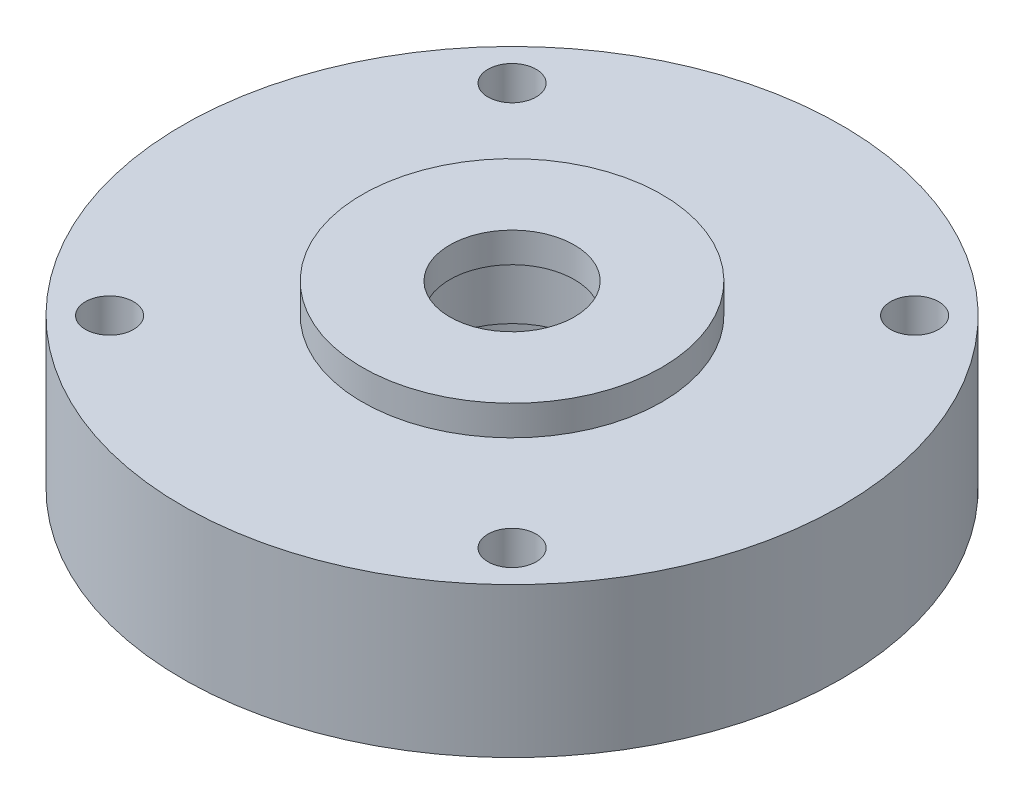
ISO-10303-21;
HEADER;
FILE_DESCRIPTION(('STEP AP214'),'2;1');
FILE_NAME('part.step','',(''),(''),'','','');
FILE_SCHEMA(('AUTOMOTIVE_DESIGN { 1 0 10303 214 1 1 1 1 }'));
ENDSEC;
DATA;
#1=APPLICATION_CONTEXT('core data for automotive mechanical design processes');
#2=APPLICATION_PROTOCOL_DEFINITION('international standard','automotive_design',2000,#1);
#3=PRODUCT_CONTEXT('',#1,'mechanical');
#4=PRODUCT('Part','Part','',(#3));
#5=PRODUCT_RELATED_PRODUCT_CATEGORY('part','',(#4));
#6=PRODUCT_DEFINITION_FORMATION('','',#4);
#7=PRODUCT_DEFINITION_CONTEXT('part definition',#1,'design');
#8=PRODUCT_DEFINITION('design','',#6,#7);
#9=PRODUCT_DEFINITION_SHAPE('','',#8);
#10=(LENGTH_UNIT() NAMED_UNIT(*) SI_UNIT(.MILLI.,.METRE.));
#11=(NAMED_UNIT(*) PLANE_ANGLE_UNIT() SI_UNIT($,.RADIAN.));
#12=(NAMED_UNIT(*) SI_UNIT($,.STERADIAN.) SOLID_ANGLE_UNIT());
#13=UNCERTAINTY_MEASURE_WITH_UNIT(LENGTH_MEASURE(1.E-05),#10,'distance_accuracy_value','');
#14=(GEOMETRIC_REPRESENTATION_CONTEXT(3) GLOBAL_UNCERTAINTY_ASSIGNED_CONTEXT((#13)) GLOBAL_UNIT_ASSIGNED_CONTEXT((#10,
#11,#12)) REPRESENTATION_CONTEXT('',''));
#15=CARTESIAN_POINT('',(0.,0.,0.));
#16=DIRECTION('',(0.,0.,1.));
#17=DIRECTION('',(1.,0.,0.));
#18=AXIS2_PLACEMENT_3D('',#15,#16,#17);
#19=CARTESIAN_POINT('',(-7.9375,9.525,0.));
#20=DIRECTION('',(0.,1.,0.));
#21=DIRECTION('',(-1.,0.,0.));
#22=AXIS2_PLACEMENT_3D('',#19,#20,#21);
#23=PLANE('',#22);
#24=CARTESIAN_POINT('',(0.,9.525,0.));
#25=DIRECTION('',(0.,-1.,0.));
#26=DIRECTION('',(1.,0.,0.));
#27=AXIS2_PLACEMENT_3D('',#24,#25,#26);
#28=CIRCLE('',#27,7.9375);
#29=CARTESIAN_POINT('',(7.9375,9.525,0.));
#30=VERTEX_POINT('',#29);
#31=EDGE_CURVE('E90',#30,#30,#28,.T.);
#32=ORIENTED_EDGE('',*,*,#31,.F.);
#33=EDGE_LOOP('',(#32));
#34=FACE_BOUND('',#33,.T.);
#35=CARTESIAN_POINT('',(0.,9.525,0.));
#36=DIRECTION('',(0.,-1.,0.));
#37=DIRECTION('',(1.,0.,0.));
#38=AXIS2_PLACEMENT_3D('',#35,#36,#37);
#39=CIRCLE('',#38,15.0125);
#40=CARTESIAN_POINT('',(15.0125,9.525,0.));
#41=VERTEX_POINT('',#40);
#42=EDGE_CURVE('E10',#41,#41,#39,.T.);
#43=ORIENTED_EDGE('',*,*,#42,.T.);
#44=EDGE_LOOP('',(#43));
#45=FACE_BOUND('',#44,.T.);
#46=ADVANCED_FACE('F41',(#34,#45),#23,.F.);
#47=CARTESIAN_POINT('',(0.,0.,0.));
#48=DIRECTION('',(0.,-1.,0.));
#49=DIRECTION('',(1.,0.,0.));
#50=AXIS2_PLACEMENT_3D('',#47,#48,#49);
#51=CYLINDRICAL_SURFACE('',#50,15.0125);
#52=ORIENTED_EDGE('',*,*,#42,.F.);
#53=EDGE_LOOP('',(#52));
#54=FACE_BOUND('',#53,.T.);
#55=CARTESIAN_POINT('',(0.,0.,0.));
#56=DIRECTION('',(0.,-1.,0.));
#57=DIRECTION('',(1.,0.,0.));
#58=AXIS2_PLACEMENT_3D('',#55,#56,#57);
#59=CIRCLE('',#58,15.0125);
#60=CARTESIAN_POINT('',(15.0125,0.,0.));
#61=VERTEX_POINT('',#60);
#62=EDGE_CURVE('E48',#61,#61,#59,.T.);
#63=ORIENTED_EDGE('',*,*,#62,.T.);
#64=EDGE_LOOP('',(#63));
#65=FACE_BOUND('',#64,.T.);
#66=ADVANCED_FACE('F167',(#54,#65),#51,.F.);
#67=CARTESIAN_POINT('',(-20.6375,0.,0.));
#68=DIRECTION('',(0.,1.,0.));
#69=DIRECTION('',(-1.,0.,0.));
#70=AXIS2_PLACEMENT_3D('',#67,#68,#69);
#71=PLANE('',#70);
#72=ORIENTED_EDGE('',*,*,#62,.F.);
#73=EDGE_LOOP('',(#72));
#74=FACE_BOUND('',#73,.T.);
#75=CARTESIAN_POINT('',(0.,0.,0.));
#76=DIRECTION('',(0.,-1.,0.));
#77=DIRECTION('',(1.,0.,0.));
#78=AXIS2_PLACEMENT_3D('',#75,#76,#77);
#79=CIRCLE('',#78,20.6375);
#80=CARTESIAN_POINT('',(20.6375,0.,0.));
#81=VERTEX_POINT('',#80);
#82=EDGE_CURVE('E53',#81,#81,#79,.T.);
#83=ORIENTED_EDGE('',*,*,#82,.T.);
#84=EDGE_LOOP('',(#83));
#85=FACE_BOUND('',#84,.T.);
#86=ADVANCED_FACE('F171',(#74,#85),#71,.F.);
#87=CARTESIAN_POINT('',(0.,0.,0.));
#88=DIRECTION('',(0.,-1.,0.));
#89=DIRECTION('',(1.,0.,0.));
#90=AXIS2_PLACEMENT_3D('',#87,#88,#89);
#91=CYLINDRICAL_SURFACE('',#90,20.6375);
#92=ORIENTED_EDGE('',*,*,#82,.F.);
#93=EDGE_LOOP('',(#92));
#94=FACE_BOUND('',#93,.T.);
#95=CARTESIAN_POINT('',(0.,3.1369,0.));
#96=DIRECTION('',(0.,-1.,0.));
#97=DIRECTION('',(1.,0.,0.));
#98=AXIS2_PLACEMENT_3D('',#95,#96,#97);
#99=CIRCLE('',#98,20.6375);
#100=CARTESIAN_POINT('',(20.6375,3.1369,0.));
#101=VERTEX_POINT('',#100);
#102=EDGE_CURVE('E57',#101,#101,#99,.T.);
#103=ORIENTED_EDGE('',*,*,#102,.T.);
#104=EDGE_LOOP('',(#103));
#105=FACE_BOUND('',#104,.T.);
#106=ADVANCED_FACE('F176',(#94,#105),#91,.T.);
#107=CARTESIAN_POINT('',(-25.4,3.1369,0.));
#108=DIRECTION('',(0.,1.,0.));
#109=DIRECTION('',(-1.,0.,0.));
#110=AXIS2_PLACEMENT_3D('',#107,#108,#109);
#111=PLANE('',#110);
#112=ORIENTED_EDGE('',*,*,#102,.F.);
#113=EDGE_LOOP('',(#112));
#114=FACE_BOUND('',#113,.T.);
#115=CARTESIAN_POINT('',(0.,3.1369,0.));
#116=DIRECTION('',(0.,-1.,0.));
#117=DIRECTION('',(1.,0.,0.));
#118=AXIS2_PLACEMENT_3D('',#115,#116,#117);
#119=CIRCLE('',#118,25.4);
#120=CARTESIAN_POINT('',(25.4,3.1369,0.));
#121=VERTEX_POINT('',#120);
#122=EDGE_CURVE('E62',#121,#121,#119,.T.);
#123=ORIENTED_EDGE('',*,*,#122,.T.);
#124=EDGE_LOOP('',(#123));
#125=FACE_BOUND('',#124,.T.);
#126=ADVANCED_FACE('F182',(#114,#125),#111,.F.);
#127=CARTESIAN_POINT('',(0.,0.,0.));
#128=DIRECTION('',(0.,-1.,0.));
#129=DIRECTION('',(1.,0.,0.));
#130=AXIS2_PLACEMENT_3D('',#127,#128,#129);
#131=CYLINDRICAL_SURFACE('',#130,25.4);
#132=ORIENTED_EDGE('',*,*,#122,.F.);
#133=EDGE_LOOP('',(#132));
#134=FACE_BOUND('',#133,.T.);
#135=CARTESIAN_POINT('',(0.,0.,0.));
#136=DIRECTION('',(0.,-1.,0.));
#137=DIRECTION('',(1.,0.,0.));
#138=AXIS2_PLACEMENT_3D('',#135,#136,#137);
#139=CIRCLE('',#138,25.4);
#140=CARTESIAN_POINT('',(25.4,0.,0.));
#141=VERTEX_POINT('',#140);
#142=EDGE_CURVE('E66',#141,#141,#139,.T.);
#143=ORIENTED_EDGE('',*,*,#142,.T.);
#144=EDGE_LOOP('',(#143));
#145=FACE_BOUND('',#144,.T.);
#146=ADVANCED_FACE('F186',(#134,#145),#131,.F.);
#147=CARTESIAN_POINT('',(-34.925,0.,0.));
#148=DIRECTION('',(0.,1.,0.));
#149=DIRECTION('',(-1.,0.,0.));
#150=AXIS2_PLACEMENT_3D('',#147,#148,#149);
#151=PLANE('',#150);
#152=CARTESIAN_POINT('',(-21.3281082875394,0.,-21.3281082875391));
#153=DIRECTION('',(0.,1.,0.));
#154=DIRECTION('',(0.,0.,1.));
#155=AXIS2_PLACEMENT_3D('',#152,#153,#154);
#156=CIRCLE('',#155,2.5527);
#157=CARTESIAN_POINT('',(-21.3281082875394,0.,-18.7754082875391));
#158=VERTEX_POINT('',#157);
#159=EDGE_CURVE('E111',#158,#158,#156,.T.);
#160=ORIENTED_EDGE('',*,*,#159,.T.);
#161=EDGE_LOOP('',(#160));
#162=FACE_BOUND('',#161,.T.);
#163=CARTESIAN_POINT('',(21.3281082875391,0.,-21.3281082875394));
#164=DIRECTION('',(0.,1.,0.));
#165=DIRECTION('',(0.,0.,1.));
#166=AXIS2_PLACEMENT_3D('',#163,#164,#165);
#167=CIRCLE('',#166,2.5527);
#168=CARTESIAN_POINT('',(21.3281082875391,0.,-18.7754082875394));
#169=VERTEX_POINT('',#168);
#170=EDGE_CURVE('E105',#169,#169,#167,.T.);
#171=ORIENTED_EDGE('',*,*,#170,.T.);
#172=EDGE_LOOP('',(#171));
#173=FACE_BOUND('',#172,.T.);
#174=CARTESIAN_POINT('',(21.3281082875394,0.,21.3281082875391));
#175=DIRECTION('',(0.,1.,0.));
#176=DIRECTION('',(0.,0.,1.));
#177=AXIS2_PLACEMENT_3D('',#174,#175,#176);
#178=CIRCLE('',#177,2.5527);
#179=CARTESIAN_POINT('',(21.3281082875394,0.,23.8808082875391));
#180=VERTEX_POINT('',#179);
#181=EDGE_CURVE('E99',#180,#180,#178,.T.);
#182=ORIENTED_EDGE('',*,*,#181,.T.);
#183=EDGE_LOOP('',(#182));
#184=FACE_BOUND('',#183,.T.);
#185=CARTESIAN_POINT('',(-21.3281082875391,0.,21.3281082875394));
#186=DIRECTION('',(0.,1.,0.));
#187=DIRECTION('',(0.,0.,1.));
#188=AXIS2_PLACEMENT_3D('',#185,#186,#187);
#189=CIRCLE('',#188,2.5527);
#190=CARTESIAN_POINT('',(-21.3281082875391,0.,23.8808082875394));
#191=VERTEX_POINT('',#190);
#192=EDGE_CURVE('E93',#191,#191,#189,.T.);
#193=ORIENTED_EDGE('',*,*,#192,.T.);
#194=EDGE_LOOP('',(#193));
#195=FACE_BOUND('',#194,.T.);
#196=ORIENTED_EDGE('',*,*,#142,.F.);
#197=EDGE_LOOP('',(#196));
#198=FACE_BOUND('',#197,.T.);
#199=CARTESIAN_POINT('',(0.,0.,0.));
#200=DIRECTION('',(0.,-1.,0.));
#201=DIRECTION('',(1.,0.,0.));
#202=AXIS2_PLACEMENT_3D('',#199,#200,#201);
#203=CIRCLE('',#202,34.925);
#204=CARTESIAN_POINT('',(34.925,0.,0.));
#205=VERTEX_POINT('',#204);
#206=EDGE_CURVE('E69',#205,#205,#203,.T.);
#207=ORIENTED_EDGE('',*,*,#206,.T.);
#208=EDGE_LOOP('',(#207));
#209=FACE_BOUND('',#208,.T.);
#210=ADVANCED_FACE('F190',(#162,#173,#184,#195,#198,#209),#151,.F.);
#211=CARTESIAN_POINT('',(0.,0.,0.));
#212=DIRECTION('',(0.,-1.,0.));
#213=DIRECTION('',(1.,0.,0.));
#214=AXIS2_PLACEMENT_3D('',#211,#212,#213);
#215=CYLINDRICAL_SURFACE('',#214,34.925);
#216=ORIENTED_EDGE('',*,*,#206,.F.);
#217=EDGE_LOOP('',(#216));
#218=FACE_BOUND('',#217,.T.);
#219=CARTESIAN_POINT('',(0.,15.875,0.));
#220=DIRECTION('',(0.,-1.,0.));
#221=DIRECTION('',(1.,0.,0.));
#222=AXIS2_PLACEMENT_3D('',#219,#220,#221);
#223=CIRCLE('',#222,34.925);
#224=CARTESIAN_POINT('',(34.925,15.875,0.));
#225=VERTEX_POINT('',#224);
#226=EDGE_CURVE('E72',#225,#225,#223,.T.);
#227=ORIENTED_EDGE('',*,*,#226,.T.);
#228=EDGE_LOOP('',(#227));
#229=FACE_BOUND('',#228,.T.);
#230=ADVANCED_FACE('F124',(#218,#229),#215,.T.);
#231=CARTESIAN_POINT('',(-15.875,15.875,0.));
#232=DIRECTION('',(0.,-1.,0.));
#233=DIRECTION('',(1.,0.,0.));
#234=AXIS2_PLACEMENT_3D('',#231,#232,#233);
#235=PLANE('',#234);
#236=CARTESIAN_POINT('',(-21.3281082875394,15.875,-21.3281082875391));
#237=DIRECTION('',(0.,1.,0.));
#238=DIRECTION('',(0.,0.,1.));
#239=AXIS2_PLACEMENT_3D('',#236,#237,#238);
#240=CIRCLE('',#239,2.55269999999999);
#241=CARTESIAN_POINT('',(-21.3281082875394,15.875,-18.7754082875391));
#242=VERTEX_POINT('',#241);
#243=EDGE_CURVE('E114',#242,#242,#240,.T.);
#244=ORIENTED_EDGE('',*,*,#243,.F.);
#245=EDGE_LOOP('',(#244));
#246=FACE_BOUND('',#245,.T.);
#247=CARTESIAN_POINT('',(21.3281082875391,15.875,-21.3281082875394));
#248=DIRECTION('',(0.,1.,0.));
#249=DIRECTION('',(0.,0.,1.));
#250=AXIS2_PLACEMENT_3D('',#247,#248,#249);
#251=CIRCLE('',#250,2.55269999999999);
#252=CARTESIAN_POINT('',(21.3281082875391,15.875,-18.7754082875394));
#253=VERTEX_POINT('',#252);
#254=EDGE_CURVE('E108',#253,#253,#251,.T.);
#255=ORIENTED_EDGE('',*,*,#254,.F.);
#256=EDGE_LOOP('',(#255));
#257=FACE_BOUND('',#256,.T.);
#258=CARTESIAN_POINT('',(21.3281082875394,15.875,21.3281082875391));
#259=DIRECTION('',(0.,1.,0.));
#260=DIRECTION('',(0.,0.,1.));
#261=AXIS2_PLACEMENT_3D('',#258,#259,#260);
#262=CIRCLE('',#261,2.55269999999999);
#263=CARTESIAN_POINT('',(21.3281082875394,15.875,23.8808082875391));
#264=VERTEX_POINT('',#263);
#265=EDGE_CURVE('E102',#264,#264,#262,.T.);
#266=ORIENTED_EDGE('',*,*,#265,.F.);
#267=EDGE_LOOP('',(#266));
#268=FACE_BOUND('',#267,.T.);
#269=CARTESIAN_POINT('',(-21.3281082875391,15.875,21.3281082875394));
#270=DIRECTION('',(0.,1.,0.));
#271=DIRECTION('',(0.,0.,1.));
#272=AXIS2_PLACEMENT_3D('',#269,#270,#271);
#273=CIRCLE('',#272,2.55269999999999);
#274=CARTESIAN_POINT('',(-21.3281082875391,15.875,23.8808082875394));
#275=VERTEX_POINT('',#274);
#276=EDGE_CURVE('E96',#275,#275,#273,.T.);
#277=ORIENTED_EDGE('',*,*,#276,.F.);
#278=EDGE_LOOP('',(#277));
#279=FACE_BOUND('',#278,.T.);
#280=ORIENTED_EDGE('',*,*,#226,.F.);
#281=EDGE_LOOP('',(#280));
#282=FACE_BOUND('',#281,.T.);
#283=CARTESIAN_POINT('',(0.,15.875,0.));
#284=DIRECTION('',(0.,-1.,0.));
#285=DIRECTION('',(1.,0.,0.));
#286=AXIS2_PLACEMENT_3D('',#283,#284,#285);
#287=CIRCLE('',#286,15.875);
#288=CARTESIAN_POINT('',(15.875,15.875,0.));
#289=VERTEX_POINT('',#288);
#290=EDGE_CURVE('E75',#289,#289,#287,.T.);
#291=ORIENTED_EDGE('',*,*,#290,.T.);
#292=EDGE_LOOP('',(#291));
#293=FACE_BOUND('',#292,.T.);
#294=ADVANCED_FACE('F120',(#246,#257,#268,#279,#282,#293),#235,.F.);
#295=CARTESIAN_POINT('',(0.,0.,0.));
#296=DIRECTION('',(0.,-1.,0.));
#297=DIRECTION('',(1.,0.,0.));
#298=AXIS2_PLACEMENT_3D('',#295,#296,#297);
#299=CYLINDRICAL_SURFACE('',#298,15.875);
#300=ORIENTED_EDGE('',*,*,#290,.F.);
#301=EDGE_LOOP('',(#300));
#302=FACE_BOUND('',#301,.T.);
#303=CARTESIAN_POINT('',(0.,19.05,0.));
#304=DIRECTION('',(0.,-1.,0.));
#305=DIRECTION('',(1.,0.,0.));
#306=AXIS2_PLACEMENT_3D('',#303,#304,#305);
#307=CIRCLE('',#306,15.875);
#308=CARTESIAN_POINT('',(15.875,19.05,0.));
#309=VERTEX_POINT('',#308);
#310=EDGE_CURVE('E78',#309,#309,#307,.T.);
#311=ORIENTED_EDGE('',*,*,#310,.T.);
#312=EDGE_LOOP('',(#311));
#313=FACE_BOUND('',#312,.T.);
#314=ADVANCED_FACE('F123',(#302,#313),#299,.T.);
#315=CARTESIAN_POINT('',(-15.875,19.05,0.));
#316=DIRECTION('',(0.,-1.,0.));
#317=DIRECTION('',(1.,0.,0.));
#318=AXIS2_PLACEMENT_3D('',#315,#316,#317);
#319=PLANE('',#318);
#320=ORIENTED_EDGE('',*,*,#310,.F.);
#321=EDGE_LOOP('',(#320));
#322=FACE_BOUND('',#321,.T.);
#323=CARTESIAN_POINT('',(0.,19.05,0.));
#324=DIRECTION('',(0.,-1.,0.));
#325=DIRECTION('',(1.,0.,0.));
#326=AXIS2_PLACEMENT_3D('',#323,#324,#325);
#327=CIRCLE('',#326,6.604);
#328=CARTESIAN_POINT('',(6.604,19.05,0.));
#329=VERTEX_POINT('',#328);
#330=EDGE_CURVE('E81',#329,#329,#327,.T.);
#331=ORIENTED_EDGE('',*,*,#330,.T.);
#332=EDGE_LOOP('',(#331));
#333=FACE_BOUND('',#332,.T.);
#334=ADVANCED_FACE('F138',(#322,#333),#319,.F.);
#335=CARTESIAN_POINT('',(0.,0.,0.));
#336=DIRECTION('',(0.,-1.,0.));
#337=DIRECTION('',(1.,0.,0.));
#338=AXIS2_PLACEMENT_3D('',#335,#336,#337);
#339=CYLINDRICAL_SURFACE('',#338,6.604);
#340=ORIENTED_EDGE('',*,*,#330,.F.);
#341=EDGE_LOOP('',(#340));
#342=FACE_BOUND('',#341,.T.);
#343=CARTESIAN_POINT('',(0.,15.875,0.));
#344=DIRECTION('',(0.,-1.,0.));
#345=DIRECTION('',(1.,0.,0.));
#346=AXIS2_PLACEMENT_3D('',#343,#344,#345);
#347=CIRCLE('',#346,6.604);
#348=CARTESIAN_POINT('',(6.604,15.875,0.));
#349=VERTEX_POINT('',#348);
#350=EDGE_CURVE('E84',#349,#349,#347,.T.);
#351=ORIENTED_EDGE('',*,*,#350,.T.);
#352=EDGE_LOOP('',(#351));
#353=FACE_BOUND('',#352,.T.);
#354=ADVANCED_FACE('F144',(#342,#353),#339,.F.);
#355=CARTESIAN_POINT('',(-6.604,15.875,0.));
#356=DIRECTION('',(0.,1.,0.));
#357=DIRECTION('',(-1.,0.,0.));
#358=AXIS2_PLACEMENT_3D('',#355,#356,#357);
#359=PLANE('',#358);
#360=ORIENTED_EDGE('',*,*,#350,.F.);
#361=EDGE_LOOP('',(#360));
#362=FACE_BOUND('',#361,.T.);
#363=CARTESIAN_POINT('',(0.,15.875,0.));
#364=DIRECTION('',(0.,-1.,0.));
#365=DIRECTION('',(1.,0.,0.));
#366=AXIS2_PLACEMENT_3D('',#363,#364,#365);
#367=CIRCLE('',#366,7.9375);
#368=CARTESIAN_POINT('',(7.9375,15.875,0.));
#369=VERTEX_POINT('',#368);
#370=EDGE_CURVE('E87',#369,#369,#367,.T.);
#371=ORIENTED_EDGE('',*,*,#370,.T.);
#372=EDGE_LOOP('',(#371));
#373=FACE_BOUND('',#372,.T.);
#374=ADVANCED_FACE('F150',(#362,#373),#359,.F.);
#375=CARTESIAN_POINT('',(0.,0.,0.));
#376=DIRECTION('',(0.,-1.,0.));
#377=DIRECTION('',(1.,0.,0.));
#378=AXIS2_PLACEMENT_3D('',#375,#376,#377);
#379=CYLINDRICAL_SURFACE('',#378,7.9375);
#380=ORIENTED_EDGE('',*,*,#370,.F.);
#381=EDGE_LOOP('',(#380));
#382=FACE_BOUND('',#381,.T.);
#383=ORIENTED_EDGE('',*,*,#31,.T.);
#384=EDGE_LOOP('',(#383));
#385=FACE_BOUND('',#384,.T.);
#386=ADVANCED_FACE('F156',(#382,#385),#379,.F.);
#387=CARTESIAN_POINT('',(-21.3281082875391,15.875,21.3281082875394));
#388=DIRECTION('',(0.,1.,0.));
#389=DIRECTION('',(0.,0.,1.));
#390=AXIS2_PLACEMENT_3D('',#387,#388,#389);
#391=CYLINDRICAL_SURFACE('',#390,2.55269999999999);
#392=ORIENTED_EDGE('',*,*,#192,.F.);
#393=EDGE_LOOP('',(#392));
#394=FACE_BOUND('',#393,.T.);
#395=ORIENTED_EDGE('',*,*,#276,.T.);
#396=EDGE_LOOP('',(#395));
#397=FACE_BOUND('',#396,.T.);
#398=ADVANCED_FACE('F162',(#394,#397),#391,.F.);
#399=CARTESIAN_POINT('',(21.3281082875394,15.875,21.3281082875391));
#400=DIRECTION('',(0.,1.,0.));
#401=DIRECTION('',(0.,0.,1.));
#402=AXIS2_PLACEMENT_3D('',#399,#400,#401);
#403=CYLINDRICAL_SURFACE('',#402,2.55269999999999);
#404=ORIENTED_EDGE('',*,*,#181,.F.);
#405=EDGE_LOOP('',(#404));
#406=FACE_BOUND('',#405,.T.);
#407=ORIENTED_EDGE('',*,*,#265,.T.);
#408=EDGE_LOOP('',(#407));
#409=FACE_BOUND('',#408,.T.);
#410=ADVANCED_FACE('F200',(#406,#409),#403,.F.);
#411=CARTESIAN_POINT('',(21.3281082875391,15.875,-21.3281082875394));
#412=DIRECTION('',(0.,1.,0.));
#413=DIRECTION('',(0.,0.,1.));
#414=AXIS2_PLACEMENT_3D('',#411,#412,#413);
#415=CYLINDRICAL_SURFACE('',#414,2.55269999999999);
#416=ORIENTED_EDGE('',*,*,#170,.F.);
#417=EDGE_LOOP('',(#416));
#418=FACE_BOUND('',#417,.T.);
#419=ORIENTED_EDGE('',*,*,#254,.T.);
#420=EDGE_LOOP('',(#419));
#421=FACE_BOUND('',#420,.T.);
#422=ADVANCED_FACE('F204',(#418,#421),#415,.F.);
#423=CARTESIAN_POINT('',(-21.3281082875394,15.875,-21.3281082875391));
#424=DIRECTION('',(0.,1.,0.));
#425=DIRECTION('',(0.,0.,1.));
#426=AXIS2_PLACEMENT_3D('',#423,#424,#425);
#427=CYLINDRICAL_SURFACE('',#426,2.55269999999999);
#428=ORIENTED_EDGE('',*,*,#159,.F.);
#429=EDGE_LOOP('',(#428));
#430=FACE_BOUND('',#429,.T.);
#431=ORIENTED_EDGE('',*,*,#243,.T.);
#432=EDGE_LOOP('',(#431));
#433=FACE_BOUND('',#432,.T.);
#434=ADVANCED_FACE('F118',(#430,#433),#427,.F.);
#435=CLOSED_SHELL('',(#46,#66,#86,#106,#126,#146,#210,#230,#294,#314,#334,#354,#374,#386,#398,
#410,#422,#434));
#436=MANIFOLD_SOLID_BREP('B2',#435);
#437=ADVANCED_BREP_SHAPE_REPRESENTATION('',(#18,#436),#14);
#438=SHAPE_DEFINITION_REPRESENTATION(#9,#437);
ENDSEC;
END-ISO-10303-21;
